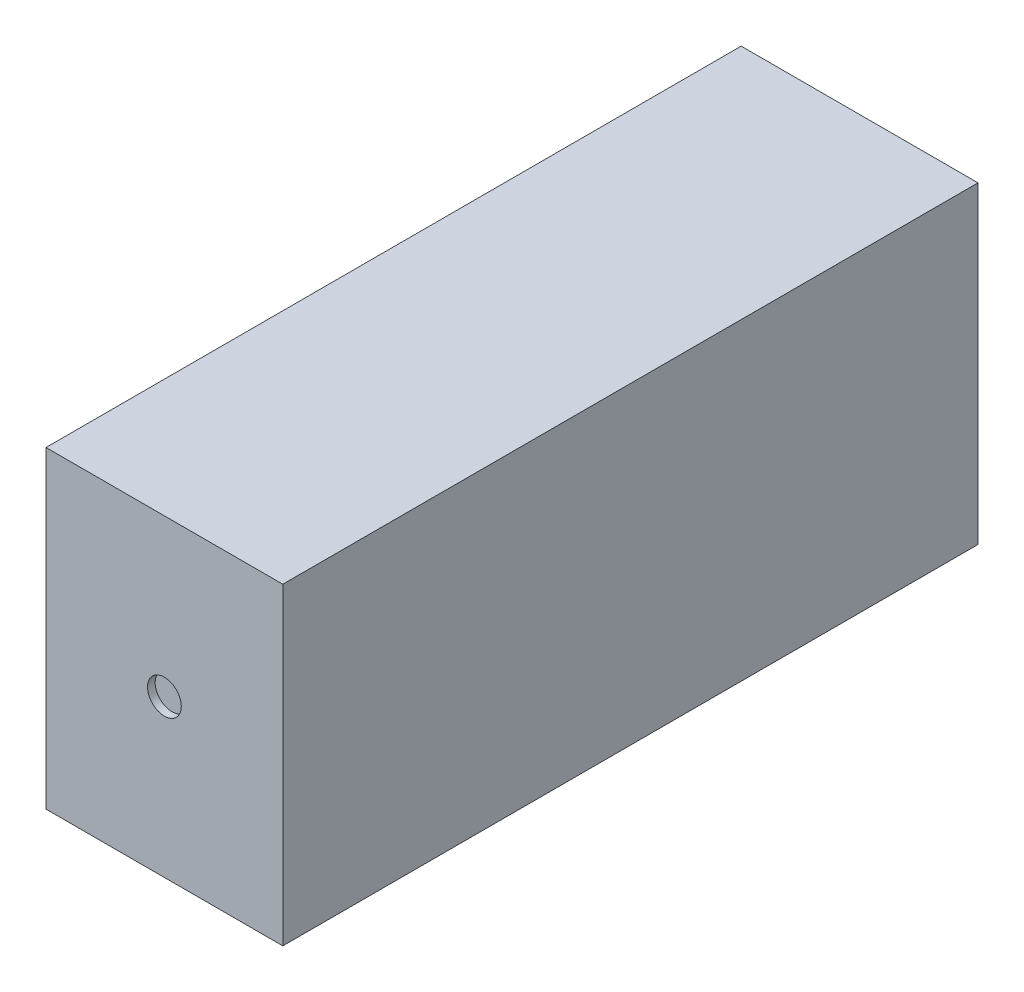
ISO-10303-21;
HEADER;
FILE_DESCRIPTION(('STEP AP214'),'2;1');
FILE_NAME('part.step','',(''),(''),'','','');
FILE_SCHEMA(('AUTOMOTIVE_DESIGN { 1 0 10303 214 1 1 1 1 }'));
ENDSEC;
DATA;
#1=APPLICATION_CONTEXT('core data for automotive mechanical design processes');
#2=APPLICATION_PROTOCOL_DEFINITION('international standard','automotive_design',2000,#1);
#3=PRODUCT_CONTEXT('',#1,'mechanical');
#4=PRODUCT('Part','Part','',(#3));
#5=PRODUCT_RELATED_PRODUCT_CATEGORY('part','',(#4));
#6=PRODUCT_DEFINITION_FORMATION('','',#4);
#7=PRODUCT_DEFINITION_CONTEXT('part definition',#1,'design');
#8=PRODUCT_DEFINITION('design','',#6,#7);
#9=PRODUCT_DEFINITION_SHAPE('','',#8);
#10=(LENGTH_UNIT() NAMED_UNIT(*) SI_UNIT(.MILLI.,.METRE.));
#11=(NAMED_UNIT(*) PLANE_ANGLE_UNIT() SI_UNIT($,.RADIAN.));
#12=(NAMED_UNIT(*) SI_UNIT($,.STERADIAN.) SOLID_ANGLE_UNIT());
#13=UNCERTAINTY_MEASURE_WITH_UNIT(LENGTH_MEASURE(1.E-05),#10,'distance_accuracy_value','');
#14=(GEOMETRIC_REPRESENTATION_CONTEXT(3) GLOBAL_UNCERTAINTY_ASSIGNED_CONTEXT((#13)) GLOBAL_UNIT_ASSIGNED_CONTEXT((#10,
#11,#12)) REPRESENTATION_CONTEXT('',''));
#15=CARTESIAN_POINT('',(0.,0.,0.));
#16=DIRECTION('',(0.,0.,1.));
#17=DIRECTION('',(1.,0.,0.));
#18=AXIS2_PLACEMENT_3D('',#15,#16,#17);
#19=CARTESIAN_POINT('',(0.,0.,231.14));
#20=DIRECTION('',(1.,0.,0.));
#21=DIRECTION('',(0.,0.,-1.));
#22=AXIS2_PLACEMENT_3D('',#19,#20,#21);
#23=PLANE('',#22);
#24=DIRECTION('',(0.,-1.,0.));
#25=VECTOR('',#24,1.);
#26=CARTESIAN_POINT('',(0.,0.,0.));
#27=LINE('',#26,#25);
#28=CARTESIAN_POINT('',(0.,104.14,0.));
#29=VERTEX_POINT('',#28);
#30=CARTESIAN_POINT('',(0.,0.,0.));
#31=VERTEX_POINT('',#30);
#32=EDGE_CURVE('E95',#29,#31,#27,.T.);
#33=ORIENTED_EDGE('',*,*,#32,.T.);
#34=DIRECTION('',(0.,0.,-1.));
#35=VECTOR('',#34,1.);
#36=CARTESIAN_POINT('',(0.,0.,231.14));
#37=LINE('',#36,#35);
#38=CARTESIAN_POINT('',(0.,0.,231.14));
#39=VERTEX_POINT('',#38);
#40=EDGE_CURVE('E11',#39,#31,#37,.T.);
#41=ORIENTED_EDGE('',*,*,#40,.F.);
#42=DIRECTION('',(0.,-1.,0.));
#43=VECTOR('',#42,1.);
#44=CARTESIAN_POINT('',(0.,0.,231.14));
#45=LINE('',#44,#43);
#46=CARTESIAN_POINT('',(0.,104.14,231.14));
#47=VERTEX_POINT('',#46);
#48=EDGE_CURVE('E83',#47,#39,#45,.T.);
#49=ORIENTED_EDGE('',*,*,#48,.F.);
#50=DIRECTION('',(0.,0.,-1.));
#51=VECTOR('',#50,1.);
#52=CARTESIAN_POINT('',(0.,104.14,231.14));
#53=LINE('',#52,#51);
#54=EDGE_CURVE('E91',#47,#29,#53,.T.);
#55=ORIENTED_EDGE('',*,*,#54,.T.);
#56=EDGE_LOOP('',(#33,#41,#49,#55));
#57=FACE_BOUND('',#56,.T.);
#58=ADVANCED_FACE('F32',(#57),#23,.F.);
#59=CARTESIAN_POINT('',(0.,0.,231.14));
#60=DIRECTION('',(0.,1.,0.));
#61=DIRECTION('',(0.,0.,1.));
#62=AXIS2_PLACEMENT_3D('',#59,#60,#61);
#63=PLANE('',#62);
#64=DIRECTION('',(1.,0.,0.));
#65=VECTOR('',#64,1.);
#66=CARTESIAN_POINT('',(0.,0.,0.));
#67=LINE('',#66,#65);
#68=CARTESIAN_POINT('',(78.74,0.,0.));
#69=VERTEX_POINT('',#68);
#70=EDGE_CURVE('E87',#31,#69,#67,.T.);
#71=ORIENTED_EDGE('',*,*,#70,.T.);
#72=DIRECTION('',(0.,0.,-1.));
#73=VECTOR('',#72,1.);
#74=CARTESIAN_POINT('',(78.74,0.,231.14));
#75=LINE('',#74,#73);
#76=CARTESIAN_POINT('',(78.74,0.,231.14));
#77=VERTEX_POINT('',#76);
#78=EDGE_CURVE('E40',#77,#69,#75,.T.);
#79=ORIENTED_EDGE('',*,*,#78,.F.);
#80=DIRECTION('',(1.,0.,0.));
#81=VECTOR('',#80,1.);
#82=CARTESIAN_POINT('',(0.,0.,231.14));
#83=LINE('',#82,#81);
#84=EDGE_CURVE('E78',#39,#77,#83,.T.);
#85=ORIENTED_EDGE('',*,*,#84,.F.);
#86=ORIENTED_EDGE('',*,*,#40,.T.);
#87=EDGE_LOOP('',(#71,#79,#85,#86));
#88=FACE_BOUND('',#87,.T.);
#89=ADVANCED_FACE('F86',(#88),#63,.F.);
#90=CARTESIAN_POINT('',(78.74,0.,231.14));
#91=DIRECTION('',(-1.,0.,0.));
#92=DIRECTION('',(0.,0.,1.));
#93=AXIS2_PLACEMENT_3D('',#90,#91,#92);
#94=PLANE('',#93);
#95=DIRECTION('',(0.,1.,0.));
#96=VECTOR('',#95,1.);
#97=CARTESIAN_POINT('',(78.74,0.,0.));
#98=LINE('',#97,#96);
#99=CARTESIAN_POINT('',(78.74,104.14,0.));
#100=VERTEX_POINT('',#99);
#101=EDGE_CURVE('E65',#69,#100,#98,.T.);
#102=ORIENTED_EDGE('',*,*,#101,.T.);
#103=DIRECTION('',(0.,0.,-1.));
#104=VECTOR('',#103,1.);
#105=CARTESIAN_POINT('',(78.74,104.14,231.14));
#106=LINE('',#105,#104);
#107=CARTESIAN_POINT('',(78.74,104.14,231.14));
#108=VERTEX_POINT('',#107);
#109=EDGE_CURVE('E88',#108,#100,#106,.T.);
#110=ORIENTED_EDGE('',*,*,#109,.F.);
#111=DIRECTION('',(0.,1.,0.));
#112=VECTOR('',#111,1.);
#113=CARTESIAN_POINT('',(78.74,0.,231.14));
#114=LINE('',#113,#112);
#115=EDGE_CURVE('E81',#77,#108,#114,.T.);
#116=ORIENTED_EDGE('',*,*,#115,.F.);
#117=ORIENTED_EDGE('',*,*,#78,.T.);
#118=EDGE_LOOP('',(#102,#110,#116,#117));
#119=FACE_BOUND('',#118,.T.);
#120=ADVANCED_FACE('F89',(#119),#94,.F.);
#121=CARTESIAN_POINT('',(0.,104.14,231.14));
#122=DIRECTION('',(0.,-1.,0.));
#123=DIRECTION('',(0.,0.,-1.));
#124=AXIS2_PLACEMENT_3D('',#121,#122,#123);
#125=PLANE('',#124);
#126=DIRECTION('',(-1.,0.,0.));
#127=VECTOR('',#126,1.);
#128=CARTESIAN_POINT('',(0.,104.14,0.));
#129=LINE('',#128,#127);
#130=EDGE_CURVE('E71',#100,#29,#129,.T.);
#131=ORIENTED_EDGE('',*,*,#130,.T.);
#132=ORIENTED_EDGE('',*,*,#54,.F.);
#133=DIRECTION('',(-1.,0.,0.));
#134=VECTOR('',#133,1.);
#135=CARTESIAN_POINT('',(0.,104.14,231.14));
#136=LINE('',#135,#134);
#137=EDGE_CURVE('E48',#108,#47,#136,.T.);
#138=ORIENTED_EDGE('',*,*,#137,.F.);
#139=ORIENTED_EDGE('',*,*,#109,.T.);
#140=EDGE_LOOP('',(#131,#132,#138,#139));
#141=FACE_BOUND('',#140,.T.);
#142=ADVANCED_FACE('F103',(#141),#125,.F.);
#143=CARTESIAN_POINT('',(0.,104.14,231.14));
#144=DIRECTION('',(0.,0.,-1.));
#145=DIRECTION('',(-1.,0.,0.));
#146=AXIS2_PLACEMENT_3D('',#143,#144,#145);
#147=PLANE('',#146);
#148=CARTESIAN_POINT('',(39.37,52.07,231.14));
#149=DIRECTION('',(0.,0.,1.));
#150=DIRECTION('',(1.,0.,0.));
#151=AXIS2_PLACEMENT_3D('',#148,#149,#150);
#152=CIRCLE('',#151,5.61416065835432);
#153=CARTESIAN_POINT('',(44.9841606583543,52.07,231.14));
#154=VERTEX_POINT('',#153);
#155=EDGE_CURVE('E109',#154,#154,#152,.T.);
#156=ORIENTED_EDGE('',*,*,#155,.F.);
#157=EDGE_LOOP('',(#156));
#158=FACE_BOUND('',#157,.T.);
#159=ORIENTED_EDGE('',*,*,#48,.T.);
#160=ORIENTED_EDGE('',*,*,#84,.T.);
#161=ORIENTED_EDGE('',*,*,#115,.T.);
#162=ORIENTED_EDGE('',*,*,#137,.T.);
#163=EDGE_LOOP('',(#159,#160,#161,#162));
#164=FACE_BOUND('',#163,.T.);
#165=ADVANCED_FACE('F79',(#158,#164),#147,.F.);
#166=CARTESIAN_POINT('',(0.,104.14,0.));
#167=DIRECTION('',(0.,0.,-1.));
#168=DIRECTION('',(-1.,0.,0.));
#169=AXIS2_PLACEMENT_3D('',#166,#167,#168);
#170=PLANE('',#169);
#171=ORIENTED_EDGE('',*,*,#32,.F.);
#172=ORIENTED_EDGE('',*,*,#130,.F.);
#173=ORIENTED_EDGE('',*,*,#101,.F.);
#174=ORIENTED_EDGE('',*,*,#70,.F.);
#175=EDGE_LOOP('',(#171,#172,#173,#174));
#176=FACE_BOUND('',#175,.T.);
#177=ADVANCED_FACE('F106',(#176),#170,.T.);
#178=CARTESIAN_POINT('',(39.37,52.07,228.6));
#179=DIRECTION('',(0.,0.,1.));
#180=DIRECTION('',(1.,0.,0.));
#181=AXIS2_PLACEMENT_3D('',#178,#179,#180);
#182=CYLINDRICAL_SURFACE('',#181,5.61416065835432);
#183=CARTESIAN_POINT('',(39.37,52.07,228.6));
#184=DIRECTION('',(0.,0.,1.));
#185=DIRECTION('',(1.,0.,0.));
#186=AXIS2_PLACEMENT_3D('',#183,#184,#185);
#187=CIRCLE('',#186,5.61416065835432);
#188=CARTESIAN_POINT('',(44.9841606583543,52.07,228.6));
#189=VERTEX_POINT('',#188);
#190=EDGE_CURVE('E98',#189,#189,#187,.T.);
#191=ORIENTED_EDGE('',*,*,#190,.F.);
#192=EDGE_LOOP('',(#191));
#193=FACE_BOUND('',#192,.T.);
#194=ORIENTED_EDGE('',*,*,#155,.T.);
#195=EDGE_LOOP('',(#194));
#196=FACE_BOUND('',#195,.T.);
#197=ADVANCED_FACE('F117',(#193,#196),#182,.F.);
#198=CARTESIAN_POINT('',(39.37,52.07,228.6));
#199=DIRECTION('',(0.,0.,1.));
#200=DIRECTION('',(1.,0.,0.));
#201=AXIS2_PLACEMENT_3D('',#198,#199,#200);
#202=PLANE('',#201);
#203=ORIENTED_EDGE('',*,*,#190,.T.);
#204=EDGE_LOOP('',(#203));
#205=FACE_BOUND('',#204,.T.);
#206=ADVANCED_FACE('F115',(#205),#202,.T.);
#207=CLOSED_SHELL('',(#58,#89,#120,#142,#165,#177,#197,#206));
#208=MANIFOLD_SOLID_BREP('B2',#207);
#209=ADVANCED_BREP_SHAPE_REPRESENTATION('',(#18,#208),#14);
#210=SHAPE_DEFINITION_REPRESENTATION(#9,#209);
ENDSEC;
END-ISO-10303-21;
